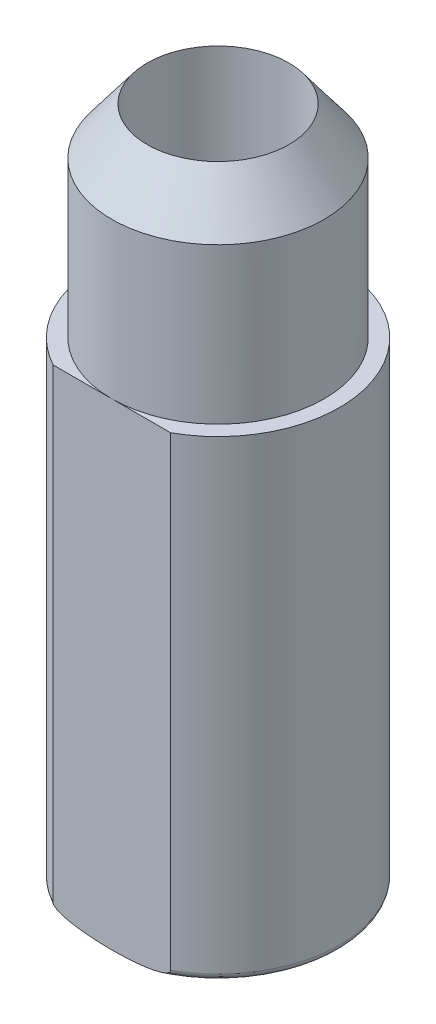
ISO-10303-21;
HEADER;
FILE_DESCRIPTION(('STEP AP214'),'2;1');
FILE_NAME('part.step','',(''),(''),'','','');
FILE_SCHEMA(('AUTOMOTIVE_DESIGN { 1 0 10303 214 1 1 1 1 }'));
ENDSEC;
DATA;
#1=APPLICATION_CONTEXT('core data for automotive mechanical design processes');
#2=APPLICATION_PROTOCOL_DEFINITION('international standard','automotive_design',2000,#1);
#3=PRODUCT_CONTEXT('',#1,'mechanical');
#4=PRODUCT('Part','Part','',(#3));
#5=PRODUCT_RELATED_PRODUCT_CATEGORY('part','',(#4));
#6=PRODUCT_DEFINITION_FORMATION('','',#4);
#7=PRODUCT_DEFINITION_CONTEXT('part definition',#1,'design');
#8=PRODUCT_DEFINITION('design','',#6,#7);
#9=PRODUCT_DEFINITION_SHAPE('','',#8);
#10=(LENGTH_UNIT() NAMED_UNIT(*) SI_UNIT(.MILLI.,.METRE.));
#11=(NAMED_UNIT(*) PLANE_ANGLE_UNIT() SI_UNIT($,.RADIAN.));
#12=(NAMED_UNIT(*) SI_UNIT($,.STERADIAN.) SOLID_ANGLE_UNIT());
#13=UNCERTAINTY_MEASURE_WITH_UNIT(LENGTH_MEASURE(1.E-05),#10,'distance_accuracy_value','');
#14=(GEOMETRIC_REPRESENTATION_CONTEXT(3) GLOBAL_UNCERTAINTY_ASSIGNED_CONTEXT((#13)) GLOBAL_UNIT_ASSIGNED_CONTEXT((#10,
#11,#12)) REPRESENTATION_CONTEXT('',''));
#15=CARTESIAN_POINT('',(0.,0.,0.));
#16=DIRECTION('',(0.,0.,1.));
#17=DIRECTION('',(1.,0.,0.));
#18=AXIS2_PLACEMENT_3D('',#15,#16,#17);
#19=CARTESIAN_POINT('',(0.,76.2,0.));
#20=DIRECTION('',(0.,-1.,0.));
#21=DIRECTION('',(0.,0.,-1.));
#22=AXIS2_PLACEMENT_3D('',#19,#20,#21);
#23=CYLINDRICAL_SURFACE('',#22,19.05);
#24=CARTESIAN_POINT('',(0.,3.175,0.));
#25=DIRECTION('',(0.,-1.,0.));
#26=DIRECTION('',(0.,0.,-1.));
#27=AXIS2_PLACEMENT_3D('',#24,#25,#26);
#28=CIRCLE('',#27,19.05);
#29=CARTESIAN_POINT('',(-9.22254159315643,3.175,16.66875));
#30=VERTEX_POINT('',#29);
#31=CARTESIAN_POINT('',(9.22254159315642,3.17500000000003,16.66875));
#32=VERTEX_POINT('',#31);
#33=EDGE_CURVE('E67',#30,#32,#28,.T.);
#34=ORIENTED_EDGE('',*,*,#33,.F.);
#35=DIRECTION('',(0.,-1.,0.));
#36=VECTOR('',#35,1.);
#37=CARTESIAN_POINT('',(-9.22254159315642,76.2,16.66875));
#38=LINE('',#37,#36);
#39=CARTESIAN_POINT('',(-9.22254159315641,76.2,16.66875));
#40=VERTEX_POINT('',#39);
#41=EDGE_CURVE('E76',#30,#40,#38,.F.);
#42=ORIENTED_EDGE('',*,*,#41,.T.);
#43=CARTESIAN_POINT('',(0.,76.2,0.));
#44=DIRECTION('',(0.,1.,0.));
#45=DIRECTION('',(0.,0.,1.));
#46=AXIS2_PLACEMENT_3D('',#43,#44,#45);
#47=CIRCLE('',#46,19.05);
#48=CARTESIAN_POINT('',(9.22254159315641,76.2,16.66875));
#49=VERTEX_POINT('',#48);
#50=EDGE_CURVE('E102',#49,#40,#47,.T.);
#51=ORIENTED_EDGE('',*,*,#50,.F.);
#52=DIRECTION('',(0.,-1.,0.));
#53=VECTOR('',#52,1.);
#54=CARTESIAN_POINT('',(9.22254159315642,76.2,16.66875));
#55=LINE('',#54,#53);
#56=EDGE_CURVE('E60',#49,#32,#55,.T.);
#57=ORIENTED_EDGE('',*,*,#56,.T.);
#58=EDGE_LOOP('',(#34,#42,#51,#57));
#59=FACE_BOUND('',#58,.T.);
#60=ADVANCED_FACE('F46',(#59),#23,.T.);
#61=CARTESIAN_POINT('',(0.,76.2,0.));
#62=DIRECTION('',(0.,-1.,0.));
#63=DIRECTION('',(0.,0.,-1.));
#64=AXIS2_PLACEMENT_3D('',#61,#62,#63);
#65=CYLINDRICAL_SURFACE('',#64,11.1125);
#66=CARTESIAN_POINT('',(0.,107.95,0.));
#67=DIRECTION('',(0.,-1.,0.));
#68=DIRECTION('',(0.,0.,-1.));
#69=AXIS2_PLACEMENT_3D('',#66,#67,#68);
#70=CIRCLE('',#69,11.1125);
#71=CARTESIAN_POINT('',(0.,107.95,-11.1125));
#72=VERTEX_POINT('',#71);
#73=EDGE_CURVE('E106',#72,#72,#70,.T.);
#74=ORIENTED_EDGE('',*,*,#73,.F.);
#75=EDGE_LOOP('',(#74));
#76=FACE_BOUND('',#75,.T.);
#77=CARTESIAN_POINT('',(0.,0.231696225433908,0.));
#78=DIRECTION('',(0.,-1.,0.));
#79=DIRECTION('',(0.,0.,-1.));
#80=AXIS2_PLACEMENT_3D('',#77,#78,#79);
#81=CIRCLE('',#80,11.1125);
#82=CARTESIAN_POINT('',(0.,0.231696225433908,-11.1125));
#83=VERTEX_POINT('',#82);
#84=EDGE_CURVE('E90',#83,#83,#81,.T.);
#85=ORIENTED_EDGE('',*,*,#84,.T.);
#86=EDGE_LOOP('',(#85));
#87=FACE_BOUND('',#86,.T.);
#88=ADVANCED_FACE('F130',(#76,#87),#65,.F.);
#89=CARTESIAN_POINT('',(24.2711047016303,0.,16.66875));
#90=DIRECTION('',(0.,0.,-1.));
#91=DIRECTION('',(-1.,0.,0.));
#92=AXIS2_PLACEMENT_3D('',#89,#90,#91);
#93=PLANE('',#92);
#94=CARTESIAN_POINT('',(9.22254159315641,3.175,16.66875));
#95=CARTESIAN_POINT('',(9.22254606778377,3.1629881546595,16.66875));
#96=CARTESIAN_POINT('',(9.22197797228461,3.15098338715665,16.66875));
#97=CARTESIAN_POINT('',(9.21973942484359,3.12709306561417,16.66875));
#98=CARTESIAN_POINT('',(9.21807047519535,3.11520737148848,16.66875));
#99=CARTESIAN_POINT('',(9.21153464750275,3.0801623785676,16.66875));
#100=CARTESIAN_POINT('',(9.2051361985547,3.0572792106606,16.66875));
#101=CARTESIAN_POINT('',(9.18647176949325,3.0061747306503,16.66875));
#102=CARTESIAN_POINT('',(9.17302515770907,2.97839604343599,16.66875));
#103=CARTESIAN_POINT('',(9.14189481847611,2.9251910866358,16.66875));
#104=CARTESIAN_POINT('',(9.1241859720157,2.89978005053384,16.66875));
#105=CARTESIAN_POINT('',(9.08792028837702,2.85390658989999,16.66875));
#106=CARTESIAN_POINT('',(9.06965820119863,2.83320573026087,16.66875));
#107=CARTESIAN_POINT('',(9.03142675859457,2.79342979725043,16.66875));
#108=CARTESIAN_POINT('',(9.01145593188844,2.7743561537631,16.66875));
#109=CARTESIAN_POINT('',(8.97022847075626,2.73760447559731,16.66875));
#110=CARTESIAN_POINT('',(8.94896999008213,2.71992853281137,16.66875));
#111=CARTESIAN_POINT('',(8.90550381857863,2.6858128314063,16.66875));
#112=CARTESIAN_POINT('',(8.88329648616773,2.66937261236882,16.66875));
#113=CARTESIAN_POINT('',(8.82479887374419,2.62814796686749,16.66875));
#114=CARTESIAN_POINT('',(8.78793962330154,2.60417204786244,16.66875));
#115=CARTESIAN_POINT('',(8.71290051102256,2.55837079888831,16.66875));
#116=CARTESIAN_POINT('',(8.67471991659821,2.53654668860634,16.66875));
#117=CARTESIAN_POINT('',(8.55861874648863,2.4736408524192,16.66875));
#118=CARTESIAN_POINT('',(8.47926479795816,2.43520950713879,16.66875));
#119=CARTESIAN_POINT('',(8.31793083478968,2.36319293073343,16.66875));
#120=CARTESIAN_POINT('',(8.23593877782103,2.32963551405348,16.66875));
#121=CARTESIAN_POINT('',(8.07058619801096,2.2664385688428,16.66875));
#122=CARTESIAN_POINT('',(7.98722748718518,2.23679426046164,16.66875));
#123=CARTESIAN_POINT('',(7.78219657233457,2.16805866969926,16.66875));
#124=CARTESIAN_POINT('',(7.65997135467144,2.1306287846481,16.66875));
#125=CARTESIAN_POINT('',(7.41413367160966,2.06059018805917,16.66875));
#126=CARTESIAN_POINT('',(7.29052082117956,2.02798285210247,16.66875));
#127=CARTESIAN_POINT('',(7.04208913157886,1.96656641431697,16.66875));
#128=CARTESIAN_POINT('',(6.91726831918551,1.937765351413,16.66875));
#129=CARTESIAN_POINT('',(6.66692579773154,1.88337285213374,16.66875));
#130=CARTESIAN_POINT('',(6.54140403407761,1.85778166950575,16.66875));
#131=CARTESIAN_POINT('',(6.16382174664767,1.78503042718831,16.66875));
#132=CARTESIAN_POINT('',(5.91097423054029,1.74194736510495,16.66875));
#133=CARTESIAN_POINT('',(5.4040500921396,1.66411888734336,16.66875));
#134=CARTESIAN_POINT('',(5.14997354228582,1.62937298623497,16.66875));
#135=CARTESIAN_POINT('',(4.64133702267686,1.56675752661278,16.66875));
#136=CARTESIAN_POINT('',(4.38677820260846,1.5388785523361,16.66875));
#137=CARTESIAN_POINT('',(3.87718180834107,1.48895052687898,16.66875));
#138=CARTESIAN_POINT('',(3.62214441763624,1.46689957480072,16.6687499999999));
#139=CARTESIAN_POINT('',(3.02357033550386,1.42121074715611,16.6687499999998));
#140=CARTESIAN_POINT('',(2.67987475124389,1.39965272953413,16.6687499999999));
#141=CARTESIAN_POINT('',(1.99196797357422,1.36477058047847,16.66875));
#142=CARTESIAN_POINT('',(1.64775665214386,1.35144903678658,16.66875));
#143=CARTESIAN_POINT('',(0.959733168110416,1.33248411640517,16.66875));
#144=CARTESIAN_POINT('',(0.615921377634202,1.32682718868932,16.66875));
#145=CARTESIAN_POINT('',(-0.0717448674756204,1.32291717100372,16.66875));
#146=CARTESIAN_POINT('',(-0.415599322753855,1.32466421140059,16.66875));
#147=CARTESIAN_POINT('',(-1.22809700860532,1.33759894352558,16.66875));
#148=CARTESIAN_POINT('',(-1.69669734710899,1.35198546979525,16.66875));
#149=CARTESIAN_POINT('',(-2.39913170048791,1.38483199565114,16.66875));
#150=CARTESIAN_POINT('',(-2.63323956924977,1.39766184681142,16.66875));
#151=CARTESIAN_POINT('',(-3.1011960673583,1.42737655651722,16.66875));
#152=CARTESIAN_POINT('',(-3.33504470196266,1.44426133125248,16.66875));
#153=CARTESIAN_POINT('',(-3.88749216309281,1.48943049656623,16.66875));
#154=CARTESIAN_POINT('',(-4.20593759152963,1.51962698881809,16.66875));
#155=CARTESIAN_POINT('',(-4.84172642256794,1.5897692612377,16.66875));
#156=CARTESIAN_POINT('',(-5.15907000596443,1.62971335706962,16.6687499999998));
#157=CARTESIAN_POINT('',(-5.69213521131905,1.70736832897352,16.6687499999999));
#158=CARTESIAN_POINT('',(-5.90833202923688,1.74180818939681,16.66875));
#159=CARTESIAN_POINT('',(-6.33951105882302,1.81778149665756,16.66875));
#160=CARTESIAN_POINT('',(-6.55449323743743,1.85931513558616,16.66875));
#161=CARTESIAN_POINT('',(-6.9157343839279,1.93720999030806,16.66875));
#162=CARTESIAN_POINT('',(-7.06251487779857,1.97114420608181,16.66875));
#163=CARTESIAN_POINT('',(-7.35468643347198,2.04447772524628,16.66875));
#164=CARTESIAN_POINT('',(-7.50007788190048,2.08387545757643,16.66875));
#165=CARTESIAN_POINT('',(-7.74444495049113,2.15670268803965,16.66875));
#166=CARTESIAN_POINT('',(-7.8439762224163,2.18825506125298,16.66875));
#167=CARTESIAN_POINT('',(-8.04159305216791,2.25578946347049,16.66875));
#168=CARTESIAN_POINT('',(-8.13967789751803,2.29177359888232,16.66875));
#169=CARTESIAN_POINT('',(-8.32823541525081,2.36745914813959,16.66875));
#170=CARTESIAN_POINT('',(-8.41883023131569,2.40684769716333,16.6687499999999));
#171=CARTESIAN_POINT('',(-8.55206327217623,2.47141235655806,16.66875));
#172=CARTESIAN_POINT('',(-8.59602727302763,2.49384529618027,16.6687500000001));
#173=CARTESIAN_POINT('',(-8.68272869927184,2.5409549514331,16.6687499999999));
#174=CARTESIAN_POINT('',(-8.72546657701292,2.56563082521089,16.6687499999995));
#175=CARTESIAN_POINT('',(-8.81399606930384,2.62075225944511,16.6687499999994));
#176=CARTESIAN_POINT('',(-8.85958027149799,2.65153487902817,16.6687499999999));
#177=CARTESIAN_POINT('',(-8.94738225939212,2.71767619293549,16.6687500000001));
#178=CARTESIAN_POINT('',(-8.98960265320783,2.75303128509789,16.66875));
#179=CARTESIAN_POINT('',(-9.05419775782409,2.81624819659929,16.6687499999999));
#180=CARTESIAN_POINT('',(-9.07830145027011,2.84232248703585,16.66875));
#181=CARTESIAN_POINT('',(-9.12277686704237,2.89752263231704,16.66875));
#182=CARTESIAN_POINT('',(-9.14315459503167,2.92664345705885,16.66875));
#183=CARTESIAN_POINT('',(-9.17301918528461,2.97899370386308,16.66875));
#184=CARTESIAN_POINT('',(-9.18394209718991,3.00139450820551,16.66875));
#185=CARTESIAN_POINT('',(-9.20209719642695,3.0476178177468,16.66875));
#186=CARTESIAN_POINT('',(-9.20934135904295,3.07143542430876,16.66875));
#187=CARTESIAN_POINT('',(-9.21704525679595,3.10871854805596,16.66875));
#188=CARTESIAN_POINT('',(-9.21909329172745,3.12186590616567,16.66875));
#189=CARTESIAN_POINT('',(-9.22184690919064,3.14833840575267,16.66875));
#190=CARTESIAN_POINT('',(-9.2225485576283,3.1616639540094,16.66875));
#191=CARTESIAN_POINT('',(-9.22254159315641,3.175,16.66875));
#192=B_SPLINE_CURVE_WITH_KNOTS('',3,(#94,#95,#96,#97,#98,#99,#100,#101,#102,#103,#104,#105,#106,
#107,#108,#109,#110,#111,#112,#113,#114,#115,#116,#117,#118,#119,#120,#121,#122,#123,#124,#125,
#126,#127,#128,#129,#130,#131,#132,#133,#134,#135,#136,#137,#138,#139,#140,#141,#142,#143,#144,
#145,#146,#147,#148,#149,#150,#151,#152,#153,#154,#155,#156,#157,#158,#159,#160,#161,#162,#163,
#164,#165,#166,#167,#168,#169,#170,#171,#172,#173,#174,#175,#176,#177,#178,#179,#180,#181,#182,
#183,#184,#185,#186,#187,#188,#189,#190,#191),.UNSPECIFIED.,.F.,.F.,(4,2,2,2,2,2,2,2,2,2,2,2,2,
2,2,2,2,2,2,2,2,2,2,2,2,2,2,2,2,2,2,2,2,2,2,2,2,2,2,2,2,2,2,2,2,2,2,2,4),(0.,0.0360092951232805,
0.0719695511225502,0.142897335979975,0.234972491496345,0.327604173848465,0.41029899762355,
0.493065755020224,0.575954130022981,0.658811466958355,0.790620132487981,0.922503085339752,
1.18672118529809,1.45239239799874,1.71773603038405,2.10107899336235,2.48453109084612,
2.86878052748982,3.25306032068498,4.022328489893,4.79155185768361,5.55971453898097,
6.3276263623073,7.36062165382101,8.39394132789881,9.42543170038312,10.4569402350837,
11.8631494090528,12.5664993008945,13.26983465661,14.2293358556368,15.1886713750367,
15.8453552815703,16.502056973149,16.9539391225309,17.4056915994253,17.7188509135646,
18.0321596503175,18.3282542697732,18.4762750879469,18.6242405762729,18.7890767151517,
18.9537837793903,19.0600945904138,19.1662325630435,19.2407579980297,19.3150392527431,
19.3548939173985,19.3948648597054),.UNSPECIFIED.);
#193=EDGE_CURVE('E11',#32,#30,#192,.T.);
#194=ORIENTED_EDGE('',*,*,#193,.F.);
#195=ORIENTED_EDGE('',*,*,#56,.F.);
#196=DIRECTION('',(-1.,0.,0.));
#197=VECTOR('',#196,1.);
#198=CARTESIAN_POINT('',(24.2711047016303,76.2,16.66875));
#199=LINE('',#198,#197);
#200=CARTESIAN_POINT('',(0.,76.2,16.66875));
#201=VERTEX_POINT('',#200);
#202=EDGE_CURVE('E115',#49,#201,#199,.T.);
#203=ORIENTED_EDGE('',*,*,#202,.T.);
#204=EDGE_CURVE('E94',#201,#40,#199,.T.);
#205=ORIENTED_EDGE('',*,*,#204,.T.);
#206=ORIENTED_EDGE('',*,*,#41,.F.);
#207=EDGE_LOOP('',(#194,#195,#203,#205,#206));
#208=FACE_BOUND('',#207,.T.);
#209=ADVANCED_FACE('F92',(#208),#93,.F.);
#210=CARTESIAN_POINT('',(0.,76.2,0.));
#211=DIRECTION('',(0.,1.,0.));
#212=DIRECTION('',(0.,0.,1.));
#213=AXIS2_PLACEMENT_3D('',#210,#211,#212);
#214=PLANE('',#213);
#215=ORIENTED_EDGE('',*,*,#202,.F.);
#216=ORIENTED_EDGE('',*,*,#50,.T.);
#217=ORIENTED_EDGE('',*,*,#204,.F.);
#218=CARTESIAN_POINT('',(0.,76.2,0.));
#219=DIRECTION('',(0.,1.,0.));
#220=DIRECTION('',(0.,0.,1.));
#221=AXIS2_PLACEMENT_3D('',#218,#219,#220);
#222=CIRCLE('',#221,16.66875);
#223=EDGE_CURVE('E97',#201,#201,#222,.T.);
#224=ORIENTED_EDGE('',*,*,#223,.F.);
#225=EDGE_LOOP('',(#215,#216,#217,#224));
#226=FACE_BOUND('',#225,.T.);
#227=ADVANCED_FACE('F129',(#226),#214,.T.);
#228=CARTESIAN_POINT('',(0.,107.95,0.));
#229=DIRECTION('',(0.,-1.,0.));
#230=DIRECTION('',(0.,0.,-1.));
#231=AXIS2_PLACEMENT_3D('',#228,#229,#230);
#232=CYLINDRICAL_SURFACE('',#231,16.66875);
#233=CARTESIAN_POINT('',(0.,100.576607209871,0.));
#234=DIRECTION('',(0.,-1.,0.));
#235=DIRECTION('',(0.,0.,-1.));
#236=AXIS2_PLACEMENT_3D('',#233,#234,#235);
#237=CIRCLE('',#236,16.66875);
#238=CARTESIAN_POINT('',(0.,100.576607209871,-16.66875));
#239=VERTEX_POINT('',#238);
#240=EDGE_CURVE('E111',#239,#239,#237,.T.);
#241=ORIENTED_EDGE('',*,*,#240,.T.);
#242=EDGE_LOOP('',(#241));
#243=FACE_BOUND('',#242,.T.);
#244=ORIENTED_EDGE('',*,*,#223,.T.);
#245=EDGE_LOOP('',(#244));
#246=FACE_BOUND('',#245,.T.);
#247=ADVANCED_FACE('F133',(#243,#246),#232,.T.);
#248=CARTESIAN_POINT('',(0.,107.95,0.));
#249=DIRECTION('',(0.,-1.,0.));
#250=DIRECTION('',(0.,0.,-1.));
#251=AXIS2_PLACEMENT_3D('',#248,#249,#250);
#252=CONICAL_SURFACE('',#251,11.1125,0.645771823237897);
#253=ORIENTED_EDGE('',*,*,#240,.F.);
#254=EDGE_LOOP('',(#253));
#255=FACE_BOUND('',#254,.T.);
#256=ORIENTED_EDGE('',*,*,#73,.T.);
#257=EDGE_LOOP('',(#256));
#258=FACE_BOUND('',#257,.T.);
#259=ADVANCED_FACE('F124',(#255,#258),#252,.T.);
#260=CARTESIAN_POINT('',(-6.34999999999998,3.175,0.));
#261=DIRECTION('',(0.,0.,-1.));
#262=DIRECTION('',(1.,0.,0.));
#263=AXIS2_PLACEMENT_3D('',#260,#261,#262);
#264=ELLIPSE('',#263,12.7,3.175);
#265=TRIMMED_CURVE('',#264,(PARAMETER_VALUE(1.0471975511966)),
(PARAMETER_VALUE(5.23598775598299)),.T.,.PARAMETER.);
#266=CARTESIAN_POINT('',(0.,0.,0.));
#267=DIRECTION('',(0.,-1.,0.));
#268=AXIS1_PLACEMENT('',#266,#267);
#269=SURFACE_OF_REVOLUTION('',#265,#268);
#270=ORIENTED_EDGE('',*,*,#84,.F.);
#271=EDGE_LOOP('',(#270));
#272=FACE_BOUND('',#271,.T.);
#273=ORIENTED_EDGE('',*,*,#193,.T.);
#274=ORIENTED_EDGE('',*,*,#33,.T.);
#275=EDGE_LOOP('',(#273,#274));
#276=FACE_BOUND('',#275,.T.);
#277=ADVANCED_FACE('F86',(#272,#276),#269,.F.);
#278=CLOSED_SHELL('',(#60,#88,#209,#227,#247,#259,#277));
#279=MANIFOLD_SOLID_BREP('B2',#278);
#280=ADVANCED_BREP_SHAPE_REPRESENTATION('',(#18,#279),#14);
#281=SHAPE_DEFINITION_REPRESENTATION(#9,#280);
ENDSEC;
END-ISO-10303-21;
